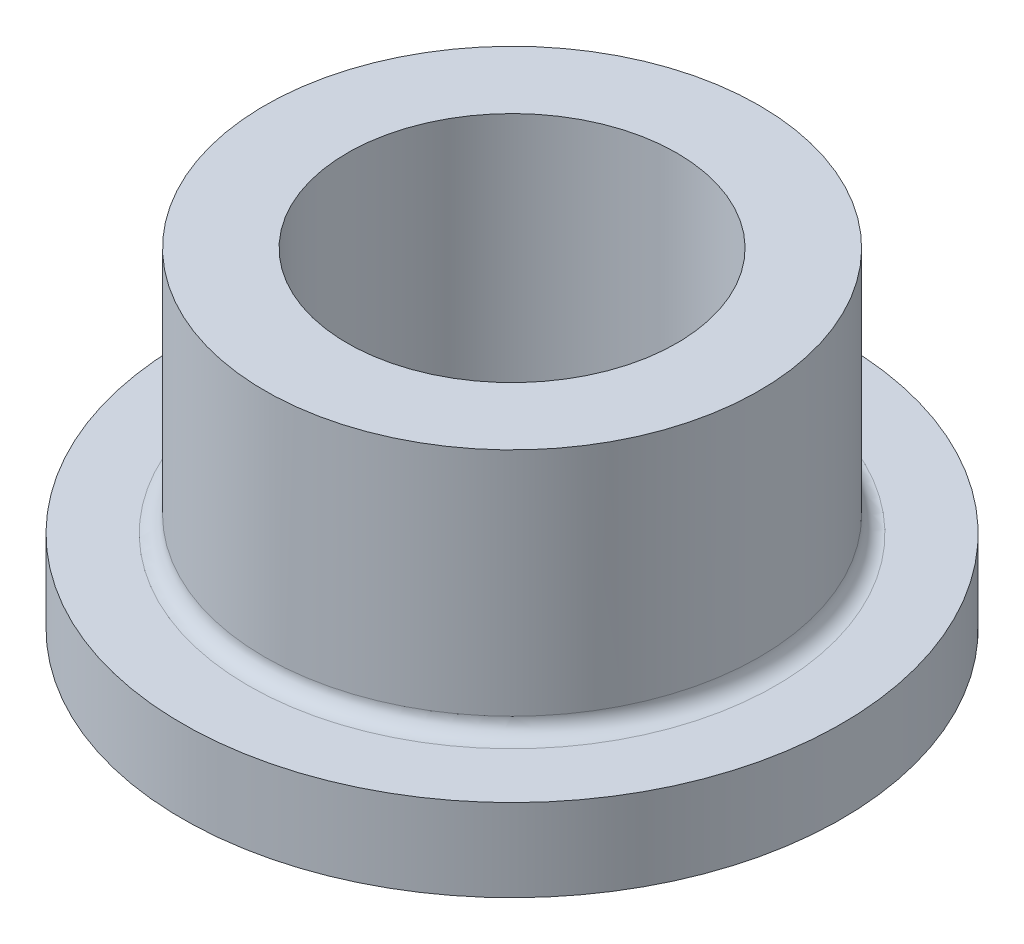
ISO-10303-21;
HEADER;
FILE_DESCRIPTION(('STEP AP214'),'2;1');
FILE_NAME('part.step','',(''),(''),'','','');
FILE_SCHEMA(('AUTOMOTIVE_DESIGN { 1 0 10303 214 1 1 1 1 }'));
ENDSEC;
DATA;
#1=APPLICATION_CONTEXT('core data for automotive mechanical design processes');
#2=APPLICATION_PROTOCOL_DEFINITION('international standard','automotive_design',2000,#1);
#3=PRODUCT_CONTEXT('',#1,'mechanical');
#4=PRODUCT('Part','Part','',(#3));
#5=PRODUCT_RELATED_PRODUCT_CATEGORY('part','',(#4));
#6=PRODUCT_DEFINITION_FORMATION('','',#4);
#7=PRODUCT_DEFINITION_CONTEXT('part definition',#1,'design');
#8=PRODUCT_DEFINITION('design','',#6,#7);
#9=PRODUCT_DEFINITION_SHAPE('','',#8);
#10=(LENGTH_UNIT() NAMED_UNIT(*) SI_UNIT(.MILLI.,.METRE.));
#11=(NAMED_UNIT(*) PLANE_ANGLE_UNIT() SI_UNIT($,.RADIAN.));
#12=(NAMED_UNIT(*) SI_UNIT($,.STERADIAN.) SOLID_ANGLE_UNIT());
#13=UNCERTAINTY_MEASURE_WITH_UNIT(LENGTH_MEASURE(1.E-05),#10,'distance_accuracy_value','');
#14=(GEOMETRIC_REPRESENTATION_CONTEXT(3) GLOBAL_UNCERTAINTY_ASSIGNED_CONTEXT((#13)) GLOBAL_UNIT_ASSIGNED_CONTEXT((#10,
#11,#12)) REPRESENTATION_CONTEXT('',''));
#15=CARTESIAN_POINT('',(0.,0.,0.));
#16=DIRECTION('',(0.,0.,1.));
#17=DIRECTION('',(1.,0.,0.));
#18=AXIS2_PLACEMENT_3D('',#15,#16,#17);
#19=CARTESIAN_POINT('',(0.,8.,-4.));
#20=DIRECTION('',(0.,1.,0.));
#21=DIRECTION('',(0.,0.,1.));
#22=AXIS2_PLACEMENT_3D('',#19,#20,#21);
#23=PLANE('',#22);
#24=CARTESIAN_POINT('',(0.,8.,0.));
#25=DIRECTION('',(0.,-1.,0.));
#26=DIRECTION('',(0.,0.,-1.));
#27=AXIS2_PLACEMENT_3D('',#24,#25,#26);
#28=CIRCLE('',#27,4.);
#29=CARTESIAN_POINT('',(0.,8.,-4.));
#30=VERTEX_POINT('',#29);
#31=EDGE_CURVE('E59',#30,#30,#28,.T.);
#32=ORIENTED_EDGE('',*,*,#31,.T.);
#33=EDGE_LOOP('',(#32));
#34=FACE_BOUND('',#33,.T.);
#35=CARTESIAN_POINT('',(0.,8.,0.));
#36=DIRECTION('',(0.,-1.,0.));
#37=DIRECTION('',(0.,0.,-1.));
#38=AXIS2_PLACEMENT_3D('',#35,#36,#37);
#39=CIRCLE('',#38,6.);
#40=CARTESIAN_POINT('',(0.,8.,-6.));
#41=VERTEX_POINT('',#40);
#42=EDGE_CURVE('E44',#41,#41,#39,.T.);
#43=ORIENTED_EDGE('',*,*,#42,.F.);
#44=EDGE_LOOP('',(#43));
#45=FACE_BOUND('',#44,.T.);
#46=ADVANCED_FACE('F33',(#34,#45),#23,.T.);
#47=CARTESIAN_POINT('',(0.,0.,0.));
#48=DIRECTION('',(0.,-1.,0.));
#49=DIRECTION('',(0.,0.,-1.));
#50=AXIS2_PLACEMENT_3D('',#47,#48,#49);
#51=CYLINDRICAL_SURFACE('',#50,6.);
#52=CARTESIAN_POINT('',(0.,2.4,0.));
#53=DIRECTION('',(0.,1.,0.));
#54=DIRECTION('',(0.,0.,1.));
#55=AXIS2_PLACEMENT_3D('',#52,#53,#54);
#56=CIRCLE('',#55,6.);
#57=CARTESIAN_POINT('',(0.,2.4,6.));
#58=VERTEX_POINT('',#57);
#59=EDGE_CURVE('E10',#58,#58,#56,.T.);
#60=ORIENTED_EDGE('',*,*,#59,.T.);
#61=EDGE_LOOP('',(#60));
#62=FACE_BOUND('',#61,.T.);
#63=ORIENTED_EDGE('',*,*,#42,.T.);
#64=EDGE_LOOP('',(#63));
#65=FACE_BOUND('',#64,.T.);
#66=ADVANCED_FACE('F79',(#62,#65),#51,.T.);
#67=CARTESIAN_POINT('',(0.,2.,-8.));
#68=DIRECTION('',(0.,1.,0.));
#69=DIRECTION('',(0.,0.,1.));
#70=AXIS2_PLACEMENT_3D('',#67,#68,#69);
#71=PLANE('',#70);
#72=CARTESIAN_POINT('',(0.,2.,0.));
#73=DIRECTION('',(0.,1.,0.));
#74=DIRECTION('',(0.,0.,1.));
#75=AXIS2_PLACEMENT_3D('',#72,#73,#74);
#76=CIRCLE('',#75,6.4);
#77=CARTESIAN_POINT('',(0.,2.,6.4));
#78=VERTEX_POINT('',#77);
#79=EDGE_CURVE('E40',#78,#78,#76,.F.);
#80=ORIENTED_EDGE('',*,*,#79,.T.);
#81=EDGE_LOOP('',(#80));
#82=FACE_BOUND('',#81,.T.);
#83=CARTESIAN_POINT('',(0.,2.,0.));
#84=DIRECTION('',(0.,-1.,0.));
#85=DIRECTION('',(0.,0.,-1.));
#86=AXIS2_PLACEMENT_3D('',#83,#84,#85);
#87=CIRCLE('',#86,8.);
#88=CARTESIAN_POINT('',(0.,2.,-8.));
#89=VERTEX_POINT('',#88);
#90=EDGE_CURVE('E48',#89,#89,#87,.T.);
#91=ORIENTED_EDGE('',*,*,#90,.F.);
#92=EDGE_LOOP('',(#91));
#93=FACE_BOUND('',#92,.T.);
#94=ADVANCED_FACE('F83',(#82,#93),#71,.T.);
#95=CARTESIAN_POINT('',(0.,0.,0.));
#96=DIRECTION('',(0.,-1.,0.));
#97=DIRECTION('',(0.,0.,-1.));
#98=AXIS2_PLACEMENT_3D('',#95,#96,#97);
#99=CYLINDRICAL_SURFACE('',#98,8.);
#100=ORIENTED_EDGE('',*,*,#90,.T.);
#101=EDGE_LOOP('',(#100));
#102=FACE_BOUND('',#101,.T.);
#103=CARTESIAN_POINT('',(0.,0.,0.));
#104=DIRECTION('',(0.,-1.,0.));
#105=DIRECTION('',(0.,0.,-1.));
#106=AXIS2_PLACEMENT_3D('',#103,#104,#105);
#107=CIRCLE('',#106,8.);
#108=CARTESIAN_POINT('',(0.,0.,-8.));
#109=VERTEX_POINT('',#108);
#110=EDGE_CURVE('E53',#109,#109,#107,.T.);
#111=ORIENTED_EDGE('',*,*,#110,.F.);
#112=EDGE_LOOP('',(#111));
#113=FACE_BOUND('',#112,.T.);
#114=ADVANCED_FACE('F75',(#102,#113),#99,.T.);
#115=CARTESIAN_POINT('',(0.,0.,-4.));
#116=DIRECTION('',(0.,-1.,0.));
#117=DIRECTION('',(0.,0.,-1.));
#118=AXIS2_PLACEMENT_3D('',#115,#116,#117);
#119=PLANE('',#118);
#120=ORIENTED_EDGE('',*,*,#110,.T.);
#121=EDGE_LOOP('',(#120));
#122=FACE_BOUND('',#121,.T.);
#123=CARTESIAN_POINT('',(0.,0.,0.));
#124=DIRECTION('',(0.,-1.,0.));
#125=DIRECTION('',(0.,0.,-1.));
#126=AXIS2_PLACEMENT_3D('',#123,#124,#125);
#127=CIRCLE('',#126,4.);
#128=CARTESIAN_POINT('',(0.,0.,-4.));
#129=VERTEX_POINT('',#128);
#130=EDGE_CURVE('E56',#129,#129,#127,.T.);
#131=ORIENTED_EDGE('',*,*,#130,.F.);
#132=EDGE_LOOP('',(#131));
#133=FACE_BOUND('',#132,.T.);
#134=ADVANCED_FACE('F67',(#122,#133),#119,.T.);
#135=CARTESIAN_POINT('',(0.,0.,0.));
#136=DIRECTION('',(0.,-1.,0.));
#137=DIRECTION('',(0.,0.,-1.));
#138=AXIS2_PLACEMENT_3D('',#135,#136,#137);
#139=CYLINDRICAL_SURFACE('',#138,4.);
#140=ORIENTED_EDGE('',*,*,#130,.T.);
#141=EDGE_LOOP('',(#140));
#142=FACE_BOUND('',#141,.T.);
#143=ORIENTED_EDGE('',*,*,#31,.F.);
#144=EDGE_LOOP('',(#143));
#145=FACE_BOUND('',#144,.T.);
#146=ADVANCED_FACE('F65',(#142,#145),#139,.F.);
#147=CARTESIAN_POINT('',(0.,2.4,0.));
#148=DIRECTION('',(0.,1.,0.));
#149=DIRECTION('',(0.,0.,1.));
#150=AXIS2_PLACEMENT_3D('',#147,#148,#149);
#151=TOROIDAL_SURFACE('',#150,6.4,0.4);
#152=ORIENTED_EDGE('',*,*,#59,.F.);
#153=EDGE_LOOP('',(#152));
#154=FACE_BOUND('',#153,.T.);
#155=ORIENTED_EDGE('',*,*,#79,.F.);
#156=EDGE_LOOP('',(#155));
#157=FACE_BOUND('',#156,.T.);
#158=ADVANCED_FACE('F35',(#154,#157),#151,.F.);
#159=CLOSED_SHELL('',(#46,#66,#94,#114,#134,#146,#158));
#160=MANIFOLD_SOLID_BREP('B2',#159);
#161=ADVANCED_BREP_SHAPE_REPRESENTATION('',(#18,#160),#14);
#162=SHAPE_DEFINITION_REPRESENTATION(#9,#161);
ENDSEC;
END-ISO-10303-21;
